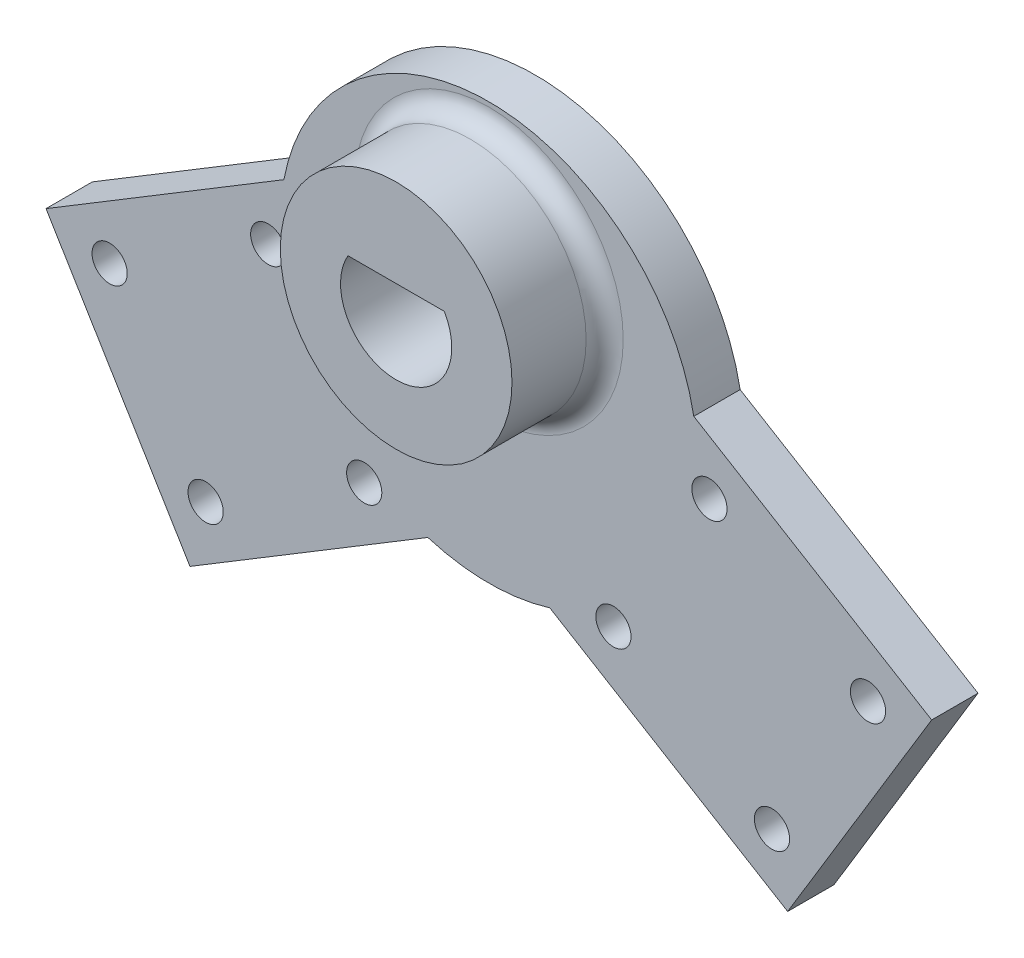
ISO-10303-21;
HEADER;
FILE_DESCRIPTION(('STEP AP214'),'2;1');
FILE_NAME('part.step','',(''),(''),'','','');
FILE_SCHEMA(('AUTOMOTIVE_DESIGN { 1 0 10303 214 1 1 1 1 }'));
ENDSEC;
DATA;
#1=APPLICATION_CONTEXT('core data for automotive mechanical design processes');
#2=APPLICATION_PROTOCOL_DEFINITION('international standard','automotive_design',2000,#1);
#3=PRODUCT_CONTEXT('',#1,'mechanical');
#4=PRODUCT('Part','Part','',(#3));
#5=PRODUCT_RELATED_PRODUCT_CATEGORY('part','',(#4));
#6=PRODUCT_DEFINITION_FORMATION('','',#4);
#7=PRODUCT_DEFINITION_CONTEXT('part definition',#1,'design');
#8=PRODUCT_DEFINITION('design','',#6,#7);
#9=PRODUCT_DEFINITION_SHAPE('','',#8);
#10=(LENGTH_UNIT() NAMED_UNIT(*) SI_UNIT(.MILLI.,.METRE.));
#11=(NAMED_UNIT(*) PLANE_ANGLE_UNIT() SI_UNIT($,.RADIAN.));
#12=(NAMED_UNIT(*) SI_UNIT($,.STERADIAN.) SOLID_ANGLE_UNIT());
#13=UNCERTAINTY_MEASURE_WITH_UNIT(LENGTH_MEASURE(1.E-05),#10,'distance_accuracy_value','');
#14=(GEOMETRIC_REPRESENTATION_CONTEXT(3) GLOBAL_UNCERTAINTY_ASSIGNED_CONTEXT((#13)) GLOBAL_UNIT_ASSIGNED_CONTEXT((#10,
#11,#12)) REPRESENTATION_CONTEXT('',''));
#15=CARTESIAN_POINT('',(0.,0.,0.));
#16=DIRECTION('',(0.,0.,1.));
#17=DIRECTION('',(1.,0.,0.));
#18=AXIS2_PLACEMENT_3D('',#15,#16,#17);
#19=CARTESIAN_POINT('',(0.,0.,5.));
#20=DIRECTION('',(0.,0.,1.));
#21=DIRECTION('',(1.,0.,0.));
#22=AXIS2_PLACEMENT_3D('',#19,#20,#21);
#23=PLANE('',#22);
#24=CARTESIAN_POINT('',(0.,7.5,5.));
#25=DIRECTION('',(0.,0.,1.));
#26=DIRECTION('',(1.,0.,0.));
#27=AXIS2_PLACEMENT_3D('',#24,#25,#26);
#28=CIRCLE('',#27,14.5);
#29=CARTESIAN_POINT('',(14.5,7.5,5.));
#30=VERTEX_POINT('',#29);
#31=EDGE_CURVE('E12',#30,#30,#28,.F.);
#32=ORIENTED_EDGE('',*,*,#31,.T.);
#33=EDGE_LOOP('',(#32));
#34=FACE_BOUND('',#33,.T.);
#35=CARTESIAN_POINT('',(0.,0.,5.));
#36=DIRECTION('',(0.,0.,1.));
#37=DIRECTION('',(1.,0.,0.));
#38=AXIS2_PLACEMENT_3D('',#35,#36,#37);
#39=CIRCLE('',#38,22.5);
#40=CARTESIAN_POINT('',(-6.57836335626159,-21.5168570091683,5.));
#41=VERTEX_POINT('',#40);
#42=CARTESIAN_POINT('',(6.57836335626161,-21.5168570091683,5.));
#43=VERTEX_POINT('',#42);
#44=EDGE_CURVE('E213',#41,#43,#39,.T.);
#45=ORIENTED_EDGE('',*,*,#44,.T.);
#46=DIRECTION('',(0.85545750612787,-0.517873010698073,0.));
#47=VECTOR('',#46,1.);
#48=CARTESIAN_POINT('',(-7.76809516047109,-12.831862591918,5.));
#49=LINE('',#48,#47);
#50=CARTESIAN_POINT('',(32.2420885400977,-37.0530473301105,5.));
#51=VERTEX_POINT('',#50);
#52=EDGE_CURVE('E126',#43,#51,#49,.T.);
#53=ORIENTED_EDGE('',*,*,#52,.T.);
#54=DIRECTION('',(0.517873010698073,0.85545750612787,0.));
#55=VECTOR('',#54,1.);
#56=CARTESIAN_POINT('',(40.0101837005688,-24.2211847381924,5.));
#57=LINE('',#56,#55);
#58=CARTESIAN_POINT('',(47.7782788610399,-11.3893221462744,5.));
#59=VERTEX_POINT('',#58);
#60=EDGE_CURVE('E308',#51,#59,#57,.T.);
#61=ORIENTED_EDGE('',*,*,#60,.T.);
#62=DIRECTION('',(0.85545750612787,-0.517873010698073,0.));
#63=VECTOR('',#62,1.);
#64=CARTESIAN_POINT('',(7.76809516047109,12.831862591918,5.));
#65=LINE('',#64,#63);
#66=CARTESIAN_POINT('',(22.1145536772038,4.1468681746678,5.));
#67=VERTEX_POINT('',#66);
#68=EDGE_CURVE('E306',#67,#59,#65,.T.);
#69=ORIENTED_EDGE('',*,*,#68,.F.);
#70=CARTESIAN_POINT('',(0.,0.,5.));
#71=DIRECTION('',(0.,0.,1.));
#72=DIRECTION('',(1.,0.,0.));
#73=AXIS2_PLACEMENT_3D('',#70,#71,#72);
#74=CIRCLE('',#73,22.5);
#75=CARTESIAN_POINT('',(-22.1145536772038,4.14686817466778,5.));
#76=VERTEX_POINT('',#75);
#77=EDGE_CURVE('E152',#67,#76,#74,.T.);
#78=ORIENTED_EDGE('',*,*,#77,.T.);
#79=DIRECTION('',(-0.855457506127869,-0.517873010698073,0.));
#80=VECTOR('',#79,1.);
#81=CARTESIAN_POINT('',(-7.7680951604711,12.831862591918,5.));
#82=LINE('',#81,#80);
#83=CARTESIAN_POINT('',(-47.7782788610399,-11.3893221462744,5.));
#84=VERTEX_POINT('',#83);
#85=EDGE_CURVE('E144',#76,#84,#82,.T.);
#86=ORIENTED_EDGE('',*,*,#85,.T.);
#87=DIRECTION('',(-0.517873010698073,0.85545750612787,0.));
#88=VECTOR('',#87,1.);
#89=CARTESIAN_POINT('',(-40.0101837005688,-24.2211847381924,5.));
#90=LINE('',#89,#88);
#91=CARTESIAN_POINT('',(-32.2420885400977,-37.0530473301105,5.));
#92=VERTEX_POINT('',#91);
#93=EDGE_CURVE('E149',#92,#84,#90,.T.);
#94=ORIENTED_EDGE('',*,*,#93,.F.);
#95=DIRECTION('',(-0.855457506127869,-0.517873010698073,0.));
#96=VECTOR('',#95,1.);
#97=CARTESIAN_POINT('',(7.7680951604711,-12.831862591918,5.));
#98=LINE('',#97,#96);
#99=EDGE_CURVE('E172',#41,#92,#98,.T.);
#100=ORIENTED_EDGE('',*,*,#99,.F.);
#101=EDGE_LOOP('',(#45,#53,#61,#69,#78,#86,#94,#100));
#102=FACE_BOUND('',#101,.T.);
#103=CARTESIAN_POINT('',(30.5541660629487,-30.1863947459808,5.));
#104=DIRECTION('',(0.,0.,1.));
#105=DIRECTION('',(1.,0.,0.));
#106=AXIS2_PLACEMENT_3D('',#103,#104,#105);
#107=CIRCLE('',#106,1.9);
#108=CARTESIAN_POINT('',(32.4541660629487,-30.1863947459808,5.));
#109=VERTEX_POINT('',#108);
#110=EDGE_CURVE('E322',#109,#109,#107,.T.);
#111=ORIENTED_EDGE('',*,*,#110,.F.);
#112=EDGE_LOOP('',(#111));
#113=FACE_BOUND('',#112,.T.);
#114=CARTESIAN_POINT('',(40.9116262769102,-13.0772446234234,5.));
#115=DIRECTION('',(0.,0.,1.));
#116=DIRECTION('',(1.,0.,0.));
#117=AXIS2_PLACEMENT_3D('',#114,#115,#116);
#118=CIRCLE('',#117,1.9);
#119=CARTESIAN_POINT('',(42.8116262769102,-13.0772446234234,5.));
#120=VERTEX_POINT('',#119);
#121=EDGE_CURVE('E330',#120,#120,#118,.T.);
#122=ORIENTED_EDGE('',*,*,#121,.F.);
#123=EDGE_LOOP('',(#122));
#124=FACE_BOUND('',#123,.T.);
#125=CARTESIAN_POINT('',(23.8024761543528,-2.71978440946192,5.));
#126=DIRECTION('',(0.,0.,1.));
#127=DIRECTION('',(1.,0.,0.));
#128=AXIS2_PLACEMENT_3D('',#125,#126,#127);
#129=CIRCLE('',#128,1.9);
#130=CARTESIAN_POINT('',(25.7024761543528,-2.71978440946192,5.));
#131=VERTEX_POINT('',#130);
#132=EDGE_CURVE('E338',#131,#131,#129,.T.);
#133=ORIENTED_EDGE('',*,*,#132,.F.);
#134=EDGE_LOOP('',(#133));
#135=FACE_BOUND('',#134,.T.);
#136=CARTESIAN_POINT('',(13.4450159403913,-19.8289345320193,5.));
#137=DIRECTION('',(0.,0.,1.));
#138=DIRECTION('',(1.,0.,0.));
#139=AXIS2_PLACEMENT_3D('',#136,#137,#138);
#140=CIRCLE('',#139,1.9);
#141=CARTESIAN_POINT('',(15.3450159403913,-19.8289345320193,5.));
#142=VERTEX_POINT('',#141);
#143=EDGE_CURVE('E346',#142,#142,#140,.T.);
#144=ORIENTED_EDGE('',*,*,#143,.F.);
#145=EDGE_LOOP('',(#144));
#146=FACE_BOUND('',#145,.T.);
#147=CARTESIAN_POINT('',(-30.5541660629487,-30.1863947459808,5.));
#148=DIRECTION('',(0.,0.,1.));
#149=DIRECTION('',(1.,0.,0.));
#150=AXIS2_PLACEMENT_3D('',#147,#148,#149);
#151=CIRCLE('',#150,1.9);
#152=CARTESIAN_POINT('',(-28.6541660629487,-30.1863947459808,5.));
#153=VERTEX_POINT('',#152);
#154=EDGE_CURVE('E354',#153,#153,#151,.T.);
#155=ORIENTED_EDGE('',*,*,#154,.F.);
#156=EDGE_LOOP('',(#155));
#157=FACE_BOUND('',#156,.T.);
#158=CARTESIAN_POINT('',(-13.4450159403913,-19.8289345320193,5.));
#159=DIRECTION('',(0.,0.,1.));
#160=DIRECTION('',(1.,0.,0.));
#161=AXIS2_PLACEMENT_3D('',#158,#159,#160);
#162=CIRCLE('',#161,1.9);
#163=CARTESIAN_POINT('',(-11.5450159403913,-19.8289345320193,5.));
#164=VERTEX_POINT('',#163);
#165=EDGE_CURVE('E362',#164,#164,#162,.T.);
#166=ORIENTED_EDGE('',*,*,#165,.F.);
#167=EDGE_LOOP('',(#166));
#168=FACE_BOUND('',#167,.T.);
#169=CARTESIAN_POINT('',(-23.8024761543528,-2.71978440946193,5.));
#170=DIRECTION('',(0.,0.,1.));
#171=DIRECTION('',(1.,0.,0.));
#172=AXIS2_PLACEMENT_3D('',#169,#170,#171);
#173=CIRCLE('',#172,1.9);
#174=CARTESIAN_POINT('',(-21.9024761543528,-2.71978440946193,5.));
#175=VERTEX_POINT('',#174);
#176=EDGE_CURVE('E370',#175,#175,#173,.T.);
#177=ORIENTED_EDGE('',*,*,#176,.F.);
#178=EDGE_LOOP('',(#177));
#179=FACE_BOUND('',#178,.T.);
#180=CARTESIAN_POINT('',(-40.9116262769101,-13.0772446234234,5.));
#181=DIRECTION('',(0.,0.,1.));
#182=DIRECTION('',(1.,0.,0.));
#183=AXIS2_PLACEMENT_3D('',#180,#181,#182);
#184=CIRCLE('',#183,1.9);
#185=CARTESIAN_POINT('',(-39.0116262769101,-13.0772446234234,5.));
#186=VERTEX_POINT('',#185);
#187=EDGE_CURVE('E378',#186,#186,#184,.T.);
#188=ORIENTED_EDGE('',*,*,#187,.F.);
#189=EDGE_LOOP('',(#188));
#190=FACE_BOUND('',#189,.T.);
#191=ADVANCED_FACE('F56',(#34,#102,#113,#124,#135,#146,#157,#168,#179,#190),#23,.T.);
#192=CARTESIAN_POINT('',(0.,7.5,5.));
#193=DIRECTION('',(0.,0.,-1.));
#194=DIRECTION('',(-1.,0.,0.));
#195=AXIS2_PLACEMENT_3D('',#192,#193,#194);
#196=CYLINDRICAL_SURFACE('',#195,6.);
#197=CARTESIAN_POINT('',(0.,7.5,0.));
#198=DIRECTION('',(0.,0.,1.));
#199=DIRECTION('',(1.,0.,0.));
#200=AXIS2_PLACEMENT_3D('',#197,#198,#199);
#201=CIRCLE('',#200,6.);
#202=CARTESIAN_POINT('',(-5.19615242270664,10.5,0.));
#203=VERTEX_POINT('',#202);
#204=CARTESIAN_POINT('',(5.19615242270662,10.5,0.));
#205=VERTEX_POINT('',#204);
#206=EDGE_CURVE('E206',#203,#205,#201,.T.);
#207=ORIENTED_EDGE('',*,*,#206,.F.);
#208=DIRECTION('',(0.,0.,-1.));
#209=VECTOR('',#208,1.);
#210=CARTESIAN_POINT('',(-5.19615242270664,10.5,5.));
#211=LINE('',#210,#209);
#212=CARTESIAN_POINT('',(-5.19615242270664,10.5,15.));
#213=VERTEX_POINT('',#212);
#214=EDGE_CURVE('E110',#213,#203,#211,.T.);
#215=ORIENTED_EDGE('',*,*,#214,.F.);
#216=CARTESIAN_POINT('',(0.,7.5,15.));
#217=DIRECTION('',(0.,0.,1.));
#218=DIRECTION('',(1.,0.,0.));
#219=AXIS2_PLACEMENT_3D('',#216,#217,#218);
#220=CIRCLE('',#219,6.);
#221=CARTESIAN_POINT('',(5.19615242270662,10.5,15.));
#222=VERTEX_POINT('',#221);
#223=EDGE_CURVE('E390',#213,#222,#220,.T.);
#224=ORIENTED_EDGE('',*,*,#223,.T.);
#225=DIRECTION('',(0.,0.,-1.));
#226=VECTOR('',#225,1.);
#227=CARTESIAN_POINT('',(5.19615242270662,10.5,5.));
#228=LINE('',#227,#226);
#229=EDGE_CURVE('E117',#222,#205,#228,.T.);
#230=ORIENTED_EDGE('',*,*,#229,.T.);
#231=EDGE_LOOP('',(#207,#215,#224,#230));
#232=FACE_BOUND('',#231,.T.);
#233=ADVANCED_FACE('F252',(#232),#196,.F.);
#234=CARTESIAN_POINT('',(0.,0.,5.));
#235=DIRECTION('',(0.,0.,-1.));
#236=DIRECTION('',(-1.,0.,0.));
#237=AXIS2_PLACEMENT_3D('',#234,#235,#236);
#238=CYLINDRICAL_SURFACE('',#237,22.5);
#239=CARTESIAN_POINT('',(0.,0.,0.));
#240=DIRECTION('',(0.,0.,1.));
#241=DIRECTION('',(1.,0.,0.));
#242=AXIS2_PLACEMENT_3D('',#239,#240,#241);
#243=CIRCLE('',#242,22.5);
#244=CARTESIAN_POINT('',(-6.57836335626159,-21.5168570091683,0.));
#245=VERTEX_POINT('',#244);
#246=CARTESIAN_POINT('',(6.57836335626161,-21.5168570091683,0.));
#247=VERTEX_POINT('',#246);
#248=EDGE_CURVE('E178',#245,#247,#243,.T.);
#249=ORIENTED_EDGE('',*,*,#248,.T.);
#250=DIRECTION('',(0.,0.,-1.));
#251=VECTOR('',#250,1.);
#252=CARTESIAN_POINT('',(6.57836335626161,-21.5168570091683,5.));
#253=LINE('',#252,#251);
#254=EDGE_CURVE('E216',#43,#247,#253,.T.);
#255=ORIENTED_EDGE('',*,*,#254,.F.);
#256=ORIENTED_EDGE('',*,*,#44,.F.);
#257=DIRECTION('',(0.,0.,-1.));
#258=VECTOR('',#257,1.);
#259=CARTESIAN_POINT('',(-6.57836335626159,-21.5168570091683,5.));
#260=LINE('',#259,#258);
#261=EDGE_CURVE('E74',#41,#245,#260,.T.);
#262=ORIENTED_EDGE('',*,*,#261,.T.);
#263=EDGE_LOOP('',(#249,#255,#256,#262));
#264=FACE_BOUND('',#263,.T.);
#265=ADVANCED_FACE('F259',(#264),#238,.T.);
#266=CARTESIAN_POINT('',(-7.76809516047109,-12.831862591918,5.));
#267=DIRECTION('',(0.517873010698072,0.85545750612787,0.));
#268=DIRECTION('',(-0.85545750612787,0.517873010698072,0.));
#269=AXIS2_PLACEMENT_3D('',#266,#267,#268);
#270=PLANE('',#269);
#271=DIRECTION('',(0.85545750612787,-0.517873010698073,0.));
#272=VECTOR('',#271,1.);
#273=CARTESIAN_POINT('',(-7.76809516047109,-12.831862591918,0.));
#274=LINE('',#273,#272);
#275=CARTESIAN_POINT('',(32.2420885400977,-37.0530473301105,0.));
#276=VERTEX_POINT('',#275);
#277=EDGE_CURVE('E182',#247,#276,#274,.T.);
#278=ORIENTED_EDGE('',*,*,#277,.T.);
#279=DIRECTION('',(0.,0.,-1.));
#280=VECTOR('',#279,1.);
#281=CARTESIAN_POINT('',(32.2420885400977,-37.0530473301105,5.));
#282=LINE('',#281,#280);
#283=EDGE_CURVE('E231',#51,#276,#282,.T.);
#284=ORIENTED_EDGE('',*,*,#283,.F.);
#285=ORIENTED_EDGE('',*,*,#52,.F.);
#286=ORIENTED_EDGE('',*,*,#254,.T.);
#287=EDGE_LOOP('',(#278,#284,#285,#286));
#288=FACE_BOUND('',#287,.T.);
#289=ADVANCED_FACE('F290',(#288),#270,.F.);
#290=CARTESIAN_POINT('',(40.0101837005688,-24.2211847381924,5.));
#291=DIRECTION('',(-0.85545750612787,0.517873010698073,0.));
#292=DIRECTION('',(-0.517873010698073,-0.85545750612787,0.));
#293=AXIS2_PLACEMENT_3D('',#290,#291,#292);
#294=PLANE('',#293);
#295=DIRECTION('',(0.517873010698073,0.85545750612787,0.));
#296=VECTOR('',#295,1.);
#297=CARTESIAN_POINT('',(40.0101837005688,-24.2211847381924,0.));
#298=LINE('',#297,#296);
#299=CARTESIAN_POINT('',(47.7782788610399,-11.3893221462744,0.));
#300=VERTEX_POINT('',#299);
#301=EDGE_CURVE('E186',#276,#300,#298,.T.);
#302=ORIENTED_EDGE('',*,*,#301,.T.);
#303=DIRECTION('',(0.,0.,-1.));
#304=VECTOR('',#303,1.);
#305=CARTESIAN_POINT('',(47.7782788610399,-11.3893221462744,5.));
#306=LINE('',#305,#304);
#307=EDGE_CURVE('E228',#59,#300,#306,.T.);
#308=ORIENTED_EDGE('',*,*,#307,.F.);
#309=ORIENTED_EDGE('',*,*,#60,.F.);
#310=ORIENTED_EDGE('',*,*,#283,.T.);
#311=EDGE_LOOP('',(#302,#308,#309,#310));
#312=FACE_BOUND('',#311,.T.);
#313=ADVANCED_FACE('F286',(#312),#294,.F.);
#314=CARTESIAN_POINT('',(7.76809516047109,12.831862591918,5.));
#315=DIRECTION('',(0.517873010698072,0.85545750612787,0.));
#316=DIRECTION('',(-0.85545750612787,0.517873010698072,0.));
#317=AXIS2_PLACEMENT_3D('',#314,#315,#316);
#318=PLANE('',#317);
#319=DIRECTION('',(0.85545750612787,-0.517873010698073,0.));
#320=VECTOR('',#319,1.);
#321=CARTESIAN_POINT('',(7.76809516047109,12.831862591918,0.));
#322=LINE('',#321,#320);
#323=CARTESIAN_POINT('',(22.1145536772038,4.1468681746678,0.));
#324=VERTEX_POINT('',#323);
#325=EDGE_CURVE('E190',#324,#300,#322,.T.);
#326=ORIENTED_EDGE('',*,*,#325,.F.);
#327=DIRECTION('',(0.,0.,-1.));
#328=VECTOR('',#327,1.);
#329=CARTESIAN_POINT('',(22.1145536772038,4.1468681746678,5.));
#330=LINE('',#329,#328);
#331=EDGE_CURVE('E225',#67,#324,#330,.T.);
#332=ORIENTED_EDGE('',*,*,#331,.F.);
#333=ORIENTED_EDGE('',*,*,#68,.T.);
#334=ORIENTED_EDGE('',*,*,#307,.T.);
#335=EDGE_LOOP('',(#326,#332,#333,#334));
#336=FACE_BOUND('',#335,.T.);
#337=ADVANCED_FACE('F282',(#336),#318,.T.);
#338=CARTESIAN_POINT('',(0.,0.,5.));
#339=DIRECTION('',(0.,0.,-1.));
#340=DIRECTION('',(-1.,0.,0.));
#341=AXIS2_PLACEMENT_3D('',#338,#339,#340);
#342=CYLINDRICAL_SURFACE('',#341,22.5);
#343=CARTESIAN_POINT('',(0.,0.,0.));
#344=DIRECTION('',(0.,0.,1.));
#345=DIRECTION('',(1.,0.,0.));
#346=AXIS2_PLACEMENT_3D('',#343,#344,#345);
#347=CIRCLE('',#346,22.5);
#348=CARTESIAN_POINT('',(-22.1145536772038,4.14686817466778,0.));
#349=VERTEX_POINT('',#348);
#350=EDGE_CURVE('E194',#324,#349,#347,.T.);
#351=ORIENTED_EDGE('',*,*,#350,.T.);
#352=DIRECTION('',(0.,0.,-1.));
#353=VECTOR('',#352,1.);
#354=CARTESIAN_POINT('',(-22.1145536772038,4.14686817466778,5.));
#355=LINE('',#354,#353);
#356=EDGE_CURVE('E167',#76,#349,#355,.T.);
#357=ORIENTED_EDGE('',*,*,#356,.F.);
#358=ORIENTED_EDGE('',*,*,#77,.F.);
#359=ORIENTED_EDGE('',*,*,#331,.T.);
#360=EDGE_LOOP('',(#351,#357,#358,#359));
#361=FACE_BOUND('',#360,.T.);
#362=ADVANCED_FACE('F279',(#361),#342,.T.);
#363=CARTESIAN_POINT('',(-7.7680951604711,12.831862591918,5.));
#364=DIRECTION('',(0.517873010698073,-0.855457506127869,0.));
#365=DIRECTION('',(0.855457506127869,0.517873010698073,0.));
#366=AXIS2_PLACEMENT_3D('',#363,#364,#365);
#367=PLANE('',#366);
#368=DIRECTION('',(-0.855457506127869,-0.517873010698073,0.));
#369=VECTOR('',#368,1.);
#370=CARTESIAN_POINT('',(-7.7680951604711,12.831862591918,0.));
#371=LINE('',#370,#369);
#372=CARTESIAN_POINT('',(-47.7782788610399,-11.3893221462744,0.));
#373=VERTEX_POINT('',#372);
#374=EDGE_CURVE('E162',#349,#373,#371,.T.);
#375=ORIENTED_EDGE('',*,*,#374,.T.);
#376=DIRECTION('',(0.,0.,-1.));
#377=VECTOR('',#376,1.);
#378=CARTESIAN_POINT('',(-47.7782788610399,-11.3893221462744,5.));
#379=LINE('',#378,#377);
#380=EDGE_CURVE('E159',#84,#373,#379,.T.);
#381=ORIENTED_EDGE('',*,*,#380,.F.);
#382=ORIENTED_EDGE('',*,*,#85,.F.);
#383=ORIENTED_EDGE('',*,*,#356,.T.);
#384=EDGE_LOOP('',(#375,#381,#382,#383));
#385=FACE_BOUND('',#384,.T.);
#386=ADVANCED_FACE('F160',(#385),#367,.F.);
#387=CARTESIAN_POINT('',(-40.0101837005688,-24.2211847381924,5.));
#388=DIRECTION('',(-0.855457506127869,-0.517873010698073,0.));
#389=DIRECTION('',(0.517873010698073,-0.855457506127869,0.));
#390=AXIS2_PLACEMENT_3D('',#387,#388,#389);
#391=PLANE('',#390);
#392=DIRECTION('',(-0.517873010698073,0.85545750612787,0.));
#393=VECTOR('',#392,1.);
#394=CARTESIAN_POINT('',(-40.0101837005688,-24.2211847381924,0.));
#395=LINE('',#394,#393);
#396=CARTESIAN_POINT('',(-32.2420885400977,-37.0530473301105,0.));
#397=VERTEX_POINT('',#396);
#398=EDGE_CURVE('E199',#397,#373,#395,.T.);
#399=ORIENTED_EDGE('',*,*,#398,.F.);
#400=DIRECTION('',(0.,0.,-1.));
#401=VECTOR('',#400,1.);
#402=CARTESIAN_POINT('',(-32.2420885400977,-37.0530473301105,5.));
#403=LINE('',#402,#401);
#404=EDGE_CURVE('E168',#92,#397,#403,.T.);
#405=ORIENTED_EDGE('',*,*,#404,.F.);
#406=ORIENTED_EDGE('',*,*,#93,.T.);
#407=ORIENTED_EDGE('',*,*,#380,.T.);
#408=EDGE_LOOP('',(#399,#405,#406,#407));
#409=FACE_BOUND('',#408,.T.);
#410=ADVANCED_FACE('F170',(#409),#391,.T.);
#411=CARTESIAN_POINT('',(7.7680951604711,-12.831862591918,5.));
#412=DIRECTION('',(0.517873010698073,-0.855457506127869,0.));
#413=DIRECTION('',(0.855457506127869,0.517873010698073,0.));
#414=AXIS2_PLACEMENT_3D('',#411,#412,#413);
#415=PLANE('',#414);
#416=DIRECTION('',(-0.855457506127869,-0.517873010698073,0.));
#417=VECTOR('',#416,1.);
#418=CARTESIAN_POINT('',(7.7680951604711,-12.831862591918,0.));
#419=LINE('',#418,#417);
#420=EDGE_CURVE('E202',#245,#397,#419,.T.);
#421=ORIENTED_EDGE('',*,*,#420,.F.);
#422=ORIENTED_EDGE('',*,*,#261,.F.);
#423=ORIENTED_EDGE('',*,*,#99,.T.);
#424=ORIENTED_EDGE('',*,*,#404,.T.);
#425=EDGE_LOOP('',(#421,#422,#423,#424));
#426=FACE_BOUND('',#425,.T.);
#427=ADVANCED_FACE('F271',(#426),#415,.T.);
#428=CARTESIAN_POINT('',(0.,10.5,5.));
#429=DIRECTION('',(0.,-1.,0.));
#430=DIRECTION('',(1.,0.,0.));
#431=AXIS2_PLACEMENT_3D('',#428,#429,#430);
#432=PLANE('',#431);
#433=DIRECTION('',(-1.,0.,0.));
#434=VECTOR('',#433,1.);
#435=CARTESIAN_POINT('',(0.,10.5,0.));
#436=LINE('',#435,#434);
#437=EDGE_CURVE('E209',#205,#203,#436,.T.);
#438=ORIENTED_EDGE('',*,*,#437,.F.);
#439=ORIENTED_EDGE('',*,*,#229,.F.);
#440=DIRECTION('',(1.,0.,0.));
#441=VECTOR('',#440,1.);
#442=CARTESIAN_POINT('',(0.,10.5,15.));
#443=LINE('',#442,#441);
#444=EDGE_CURVE('E386',#213,#222,#443,.T.);
#445=ORIENTED_EDGE('',*,*,#444,.F.);
#446=ORIENTED_EDGE('',*,*,#214,.T.);
#447=EDGE_LOOP('',(#438,#439,#445,#446));
#448=FACE_BOUND('',#447,.T.);
#449=ADVANCED_FACE('F268',(#448),#432,.T.);
#450=CARTESIAN_POINT('',(0.,0.,0.));
#451=DIRECTION('',(0.,0.,1.));
#452=DIRECTION('',(1.,0.,0.));
#453=AXIS2_PLACEMENT_3D('',#450,#451,#452);
#454=PLANE('',#453);
#455=CARTESIAN_POINT('',(-40.9116262769101,-13.0772446234234,0.));
#456=DIRECTION('',(0.,0.,1.));
#457=DIRECTION('',(1.,0.,0.));
#458=AXIS2_PLACEMENT_3D('',#455,#456,#457);
#459=CIRCLE('',#458,1.9);
#460=CARTESIAN_POINT('',(-39.0116262769101,-13.0772446234234,0.));
#461=VERTEX_POINT('',#460);
#462=EDGE_CURVE('E374',#461,#461,#459,.T.);
#463=ORIENTED_EDGE('',*,*,#462,.T.);
#464=EDGE_LOOP('',(#463));
#465=FACE_BOUND('',#464,.T.);
#466=CARTESIAN_POINT('',(-23.8024761543528,-2.71978440946193,0.));
#467=DIRECTION('',(0.,0.,1.));
#468=DIRECTION('',(1.,0.,0.));
#469=AXIS2_PLACEMENT_3D('',#466,#467,#468);
#470=CIRCLE('',#469,1.9);
#471=CARTESIAN_POINT('',(-21.9024761543528,-2.71978440946193,0.));
#472=VERTEX_POINT('',#471);
#473=EDGE_CURVE('E366',#472,#472,#470,.T.);
#474=ORIENTED_EDGE('',*,*,#473,.T.);
#475=EDGE_LOOP('',(#474));
#476=FACE_BOUND('',#475,.T.);
#477=CARTESIAN_POINT('',(-13.4450159403913,-19.8289345320193,0.));
#478=DIRECTION('',(0.,0.,1.));
#479=DIRECTION('',(1.,0.,0.));
#480=AXIS2_PLACEMENT_3D('',#477,#478,#479);
#481=CIRCLE('',#480,1.9);
#482=CARTESIAN_POINT('',(-11.5450159403913,-19.8289345320193,0.));
#483=VERTEX_POINT('',#482);
#484=EDGE_CURVE('E358',#483,#483,#481,.T.);
#485=ORIENTED_EDGE('',*,*,#484,.T.);
#486=EDGE_LOOP('',(#485));
#487=FACE_BOUND('',#486,.T.);
#488=CARTESIAN_POINT('',(-30.5541660629487,-30.1863947459808,0.));
#489=DIRECTION('',(0.,0.,1.));
#490=DIRECTION('',(1.,0.,0.));
#491=AXIS2_PLACEMENT_3D('',#488,#489,#490);
#492=CIRCLE('',#491,1.9);
#493=CARTESIAN_POINT('',(-28.6541660629487,-30.1863947459808,0.));
#494=VERTEX_POINT('',#493);
#495=EDGE_CURVE('E350',#494,#494,#492,.T.);
#496=ORIENTED_EDGE('',*,*,#495,.T.);
#497=EDGE_LOOP('',(#496));
#498=FACE_BOUND('',#497,.T.);
#499=CARTESIAN_POINT('',(13.4450159403913,-19.8289345320193,0.));
#500=DIRECTION('',(0.,0.,1.));
#501=DIRECTION('',(1.,0.,0.));
#502=AXIS2_PLACEMENT_3D('',#499,#500,#501);
#503=CIRCLE('',#502,1.9);
#504=CARTESIAN_POINT('',(15.3450159403913,-19.8289345320193,0.));
#505=VERTEX_POINT('',#504);
#506=EDGE_CURVE('E342',#505,#505,#503,.T.);
#507=ORIENTED_EDGE('',*,*,#506,.T.);
#508=EDGE_LOOP('',(#507));
#509=FACE_BOUND('',#508,.T.);
#510=CARTESIAN_POINT('',(23.8024761543528,-2.71978440946192,0.));
#511=DIRECTION('',(0.,0.,1.));
#512=DIRECTION('',(1.,0.,0.));
#513=AXIS2_PLACEMENT_3D('',#510,#511,#512);
#514=CIRCLE('',#513,1.9);
#515=CARTESIAN_POINT('',(25.7024761543528,-2.71978440946192,0.));
#516=VERTEX_POINT('',#515);
#517=EDGE_CURVE('E334',#516,#516,#514,.T.);
#518=ORIENTED_EDGE('',*,*,#517,.T.);
#519=EDGE_LOOP('',(#518));
#520=FACE_BOUND('',#519,.T.);
#521=CARTESIAN_POINT('',(40.9116262769102,-13.0772446234234,0.));
#522=DIRECTION('',(0.,0.,1.));
#523=DIRECTION('',(1.,0.,0.));
#524=AXIS2_PLACEMENT_3D('',#521,#522,#523);
#525=CIRCLE('',#524,1.9);
#526=CARTESIAN_POINT('',(42.8116262769102,-13.0772446234234,0.));
#527=VERTEX_POINT('',#526);
#528=EDGE_CURVE('E326',#527,#527,#525,.T.);
#529=ORIENTED_EDGE('',*,*,#528,.T.);
#530=EDGE_LOOP('',(#529));
#531=FACE_BOUND('',#530,.T.);
#532=CARTESIAN_POINT('',(30.5541660629487,-30.1863947459808,0.));
#533=DIRECTION('',(0.,0.,1.));
#534=DIRECTION('',(1.,0.,0.));
#535=AXIS2_PLACEMENT_3D('',#532,#533,#534);
#536=CIRCLE('',#535,1.9);
#537=CARTESIAN_POINT('',(32.4541660629487,-30.1863947459808,0.));
#538=VERTEX_POINT('',#537);
#539=EDGE_CURVE('E183',#538,#538,#536,.T.);
#540=ORIENTED_EDGE('',*,*,#539,.T.);
#541=EDGE_LOOP('',(#540));
#542=FACE_BOUND('',#541,.T.);
#543=ORIENTED_EDGE('',*,*,#248,.F.);
#544=ORIENTED_EDGE('',*,*,#420,.T.);
#545=ORIENTED_EDGE('',*,*,#398,.T.);
#546=ORIENTED_EDGE('',*,*,#374,.F.);
#547=ORIENTED_EDGE('',*,*,#350,.F.);
#548=ORIENTED_EDGE('',*,*,#325,.T.);
#549=ORIENTED_EDGE('',*,*,#301,.F.);
#550=ORIENTED_EDGE('',*,*,#277,.F.);
#551=EDGE_LOOP('',(#543,#544,#545,#546,#547,#548,#549,#550));
#552=FACE_BOUND('',#551,.T.);
#553=ORIENTED_EDGE('',*,*,#206,.T.);
#554=ORIENTED_EDGE('',*,*,#437,.T.);
#555=EDGE_LOOP('',(#553,#554));
#556=FACE_BOUND('',#555,.T.);
#557=ADVANCED_FACE('F265',(#465,#476,#487,#498,#509,#520,#531,#542,#552,#556),#454,.F.);
#558=CARTESIAN_POINT('',(30.5541660629487,-30.1863947459808,5.));
#559=DIRECTION('',(0.,0.,1.));
#560=DIRECTION('',(1.,0.,0.));
#561=AXIS2_PLACEMENT_3D('',#558,#559,#560);
#562=CYLINDRICAL_SURFACE('',#561,1.9);
#563=ORIENTED_EDGE('',*,*,#539,.F.);
#564=EDGE_LOOP('',(#563));
#565=FACE_BOUND('',#564,.T.);
#566=ORIENTED_EDGE('',*,*,#110,.T.);
#567=EDGE_LOOP('',(#566));
#568=FACE_BOUND('',#567,.T.);
#569=ADVANCED_FACE('F263',(#565,#568),#562,.F.);
#570=CARTESIAN_POINT('',(40.9116262769102,-13.0772446234234,5.));
#571=DIRECTION('',(0.,0.,1.));
#572=DIRECTION('',(1.,0.,0.));
#573=AXIS2_PLACEMENT_3D('',#570,#571,#572);
#574=CYLINDRICAL_SURFACE('',#573,1.9);
#575=ORIENTED_EDGE('',*,*,#528,.F.);
#576=EDGE_LOOP('',(#575));
#577=FACE_BOUND('',#576,.T.);
#578=ORIENTED_EDGE('',*,*,#121,.T.);
#579=EDGE_LOOP('',(#578));
#580=FACE_BOUND('',#579,.T.);
#581=ADVANCED_FACE('F422',(#577,#580),#574,.F.);
#582=CARTESIAN_POINT('',(23.8024761543528,-2.71978440946192,5.));
#583=DIRECTION('',(0.,0.,1.));
#584=DIRECTION('',(1.,0.,0.));
#585=AXIS2_PLACEMENT_3D('',#582,#583,#584);
#586=CYLINDRICAL_SURFACE('',#585,1.9);
#587=ORIENTED_EDGE('',*,*,#517,.F.);
#588=EDGE_LOOP('',(#587));
#589=FACE_BOUND('',#588,.T.);
#590=ORIENTED_EDGE('',*,*,#132,.T.);
#591=EDGE_LOOP('',(#590));
#592=FACE_BOUND('',#591,.T.);
#593=ADVANCED_FACE('F419',(#589,#592),#586,.F.);
#594=CARTESIAN_POINT('',(13.4450159403913,-19.8289345320193,5.));
#595=DIRECTION('',(0.,0.,1.));
#596=DIRECTION('',(1.,0.,0.));
#597=AXIS2_PLACEMENT_3D('',#594,#595,#596);
#598=CYLINDRICAL_SURFACE('',#597,1.9);
#599=ORIENTED_EDGE('',*,*,#506,.F.);
#600=EDGE_LOOP('',(#599));
#601=FACE_BOUND('',#600,.T.);
#602=ORIENTED_EDGE('',*,*,#143,.T.);
#603=EDGE_LOOP('',(#602));
#604=FACE_BOUND('',#603,.T.);
#605=ADVANCED_FACE('F415',(#601,#604),#598,.F.);
#606=CARTESIAN_POINT('',(-30.5541660629487,-30.1863947459808,5.));
#607=DIRECTION('',(0.,0.,1.));
#608=DIRECTION('',(1.,0.,0.));
#609=AXIS2_PLACEMENT_3D('',#606,#607,#608);
#610=CYLINDRICAL_SURFACE('',#609,1.9);
#611=ORIENTED_EDGE('',*,*,#495,.F.);
#612=EDGE_LOOP('',(#611));
#613=FACE_BOUND('',#612,.T.);
#614=ORIENTED_EDGE('',*,*,#154,.T.);
#615=EDGE_LOOP('',(#614));
#616=FACE_BOUND('',#615,.T.);
#617=ADVANCED_FACE('F411',(#613,#616),#610,.F.);
#618=CARTESIAN_POINT('',(-13.4450159403913,-19.8289345320193,5.));
#619=DIRECTION('',(0.,0.,1.));
#620=DIRECTION('',(1.,0.,0.));
#621=AXIS2_PLACEMENT_3D('',#618,#619,#620);
#622=CYLINDRICAL_SURFACE('',#621,1.9);
#623=ORIENTED_EDGE('',*,*,#484,.F.);
#624=EDGE_LOOP('',(#623));
#625=FACE_BOUND('',#624,.T.);
#626=ORIENTED_EDGE('',*,*,#165,.T.);
#627=EDGE_LOOP('',(#626));
#628=FACE_BOUND('',#627,.T.);
#629=ADVANCED_FACE('F407',(#625,#628),#622,.F.);
#630=CARTESIAN_POINT('',(-23.8024761543528,-2.71978440946193,5.));
#631=DIRECTION('',(0.,0.,1.));
#632=DIRECTION('',(1.,0.,0.));
#633=AXIS2_PLACEMENT_3D('',#630,#631,#632);
#634=CYLINDRICAL_SURFACE('',#633,1.9);
#635=ORIENTED_EDGE('',*,*,#473,.F.);
#636=EDGE_LOOP('',(#635));
#637=FACE_BOUND('',#636,.T.);
#638=ORIENTED_EDGE('',*,*,#176,.T.);
#639=EDGE_LOOP('',(#638));
#640=FACE_BOUND('',#639,.T.);
#641=ADVANCED_FACE('F401',(#637,#640),#634,.F.);
#642=CARTESIAN_POINT('',(-40.9116262769101,-13.0772446234234,5.));
#643=DIRECTION('',(0.,0.,1.));
#644=DIRECTION('',(1.,0.,0.));
#645=AXIS2_PLACEMENT_3D('',#642,#643,#644);
#646=CYLINDRICAL_SURFACE('',#645,1.9);
#647=ORIENTED_EDGE('',*,*,#462,.F.);
#648=EDGE_LOOP('',(#647));
#649=FACE_BOUND('',#648,.T.);
#650=ORIENTED_EDGE('',*,*,#187,.T.);
#651=EDGE_LOOP('',(#650));
#652=FACE_BOUND('',#651,.T.);
#653=ADVANCED_FACE('F395',(#649,#652),#646,.F.);
#654=CARTESIAN_POINT('',(0.,7.5,15.));
#655=DIRECTION('',(0.,0.,1.));
#656=DIRECTION('',(1.,0.,0.));
#657=AXIS2_PLACEMENT_3D('',#654,#655,#656);
#658=PLANE('',#657);
#659=CARTESIAN_POINT('',(0.,7.5,15.));
#660=DIRECTION('',(0.,0.,1.));
#661=DIRECTION('',(1.,0.,0.));
#662=AXIS2_PLACEMENT_3D('',#659,#660,#661);
#663=CIRCLE('',#662,12.5);
#664=CARTESIAN_POINT('',(12.5,7.5,15.));
#665=VERTEX_POINT('',#664);
#666=EDGE_CURVE('E382',#665,#665,#663,.T.);
#667=ORIENTED_EDGE('',*,*,#666,.T.);
#668=EDGE_LOOP('',(#667));
#669=FACE_BOUND('',#668,.T.);
#670=ORIENTED_EDGE('',*,*,#444,.T.);
#671=ORIENTED_EDGE('',*,*,#223,.F.);
#672=EDGE_LOOP('',(#670,#671));
#673=FACE_BOUND('',#672,.T.);
#674=ADVANCED_FACE('F248',(#669,#673),#658,.T.);
#675=CARTESIAN_POINT('',(0.,7.5,15.));
#676=DIRECTION('',(0.,0.,-1.));
#677=DIRECTION('',(-1.,0.,0.));
#678=AXIS2_PLACEMENT_3D('',#675,#676,#677);
#679=CYLINDRICAL_SURFACE('',#678,12.5);
#680=CARTESIAN_POINT('',(0.,7.5,7.));
#681=DIRECTION('',(0.,0.,1.));
#682=DIRECTION('',(1.,0.,0.));
#683=AXIS2_PLACEMENT_3D('',#680,#681,#682);
#684=CIRCLE('',#683,12.5);
#685=CARTESIAN_POINT('',(12.5,7.5,7.));
#686=VERTEX_POINT('',#685);
#687=EDGE_CURVE('E66',#686,#686,#684,.T.);
#688=ORIENTED_EDGE('',*,*,#687,.T.);
#689=EDGE_LOOP('',(#688));
#690=FACE_BOUND('',#689,.T.);
#691=ORIENTED_EDGE('',*,*,#666,.F.);
#692=EDGE_LOOP('',(#691));
#693=FACE_BOUND('',#692,.T.);
#694=ADVANCED_FACE('F240',(#690,#693),#679,.T.);
#695=CARTESIAN_POINT('',(0.,7.5,7.));
#696=DIRECTION('',(0.,0.,1.));
#697=DIRECTION('',(1.,0.,0.));
#698=AXIS2_PLACEMENT_3D('',#695,#696,#697);
#699=TOROIDAL_SURFACE('',#698,14.5,2.);
#700=ORIENTED_EDGE('',*,*,#31,.F.);
#701=EDGE_LOOP('',(#700));
#702=FACE_BOUND('',#701,.T.);
#703=ORIENTED_EDGE('',*,*,#687,.F.);
#704=EDGE_LOOP('',(#703));
#705=FACE_BOUND('',#704,.T.);
#706=ADVANCED_FACE('F58',(#702,#705),#699,.F.);
#707=CLOSED_SHELL('',(#191,#233,#265,#289,#313,#337,#362,#386,#410,#427,#449,#557,#569,#581,
#593,#605,#617,#629,#641,#653,#674,#694,#706));
#708=MANIFOLD_SOLID_BREP('B2',#707);
#709=ADVANCED_BREP_SHAPE_REPRESENTATION('',(#18,#708),#14);
#710=SHAPE_DEFINITION_REPRESENTATION(#9,#709);
ENDSEC;
END-ISO-10303-21;
